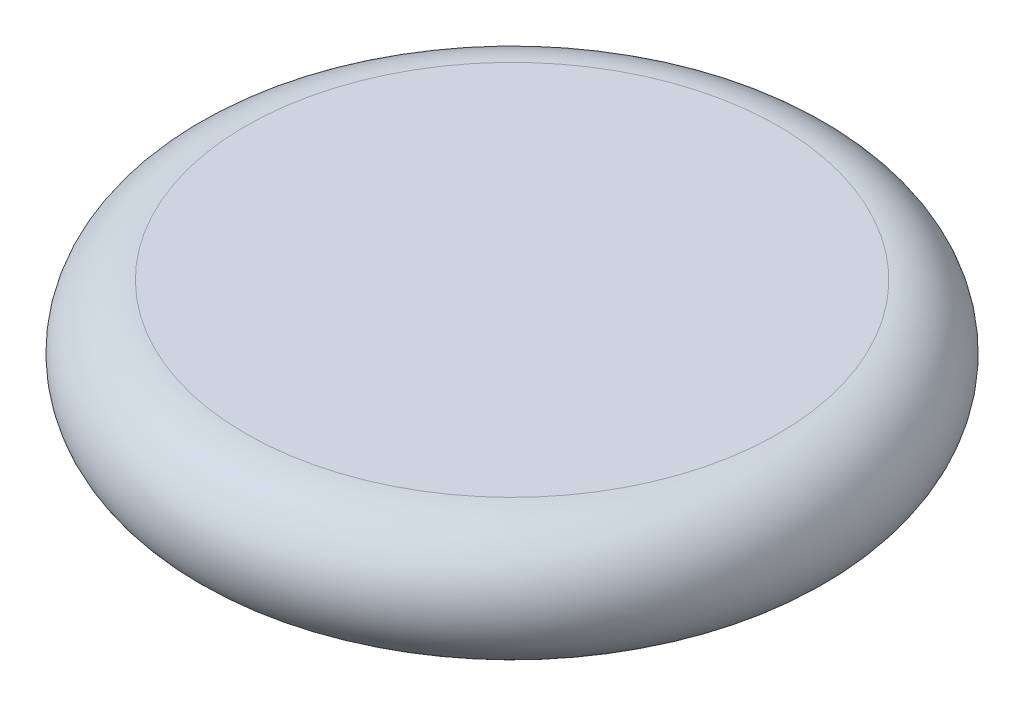
ISO-10303-21;
HEADER;
FILE_DESCRIPTION(('STEP AP214'),'2;1');
FILE_NAME('part.step','',(''),(''),'','','');
FILE_SCHEMA(('AUTOMOTIVE_DESIGN { 1 0 10303 214 1 1 1 1 }'));
ENDSEC;
DATA;
#1=APPLICATION_CONTEXT('core data for automotive mechanical design processes');
#2=APPLICATION_PROTOCOL_DEFINITION('international standard','automotive_design',2000,#1);
#3=PRODUCT_CONTEXT('',#1,'mechanical');
#4=PRODUCT('Part','Part','',(#3));
#5=PRODUCT_RELATED_PRODUCT_CATEGORY('part','',(#4));
#6=PRODUCT_DEFINITION_FORMATION('','',#4);
#7=PRODUCT_DEFINITION_CONTEXT('part definition',#1,'design');
#8=PRODUCT_DEFINITION('design','',#6,#7);
#9=PRODUCT_DEFINITION_SHAPE('','',#8);
#10=(LENGTH_UNIT() NAMED_UNIT(*) SI_UNIT(.MILLI.,.METRE.));
#11=(NAMED_UNIT(*) PLANE_ANGLE_UNIT() SI_UNIT($,.RADIAN.));
#12=(NAMED_UNIT(*) SI_UNIT($,.STERADIAN.) SOLID_ANGLE_UNIT());
#13=UNCERTAINTY_MEASURE_WITH_UNIT(LENGTH_MEASURE(1.E-05),#10,'distance_accuracy_value','');
#14=(GEOMETRIC_REPRESENTATION_CONTEXT(3) GLOBAL_UNCERTAINTY_ASSIGNED_CONTEXT((#13)) GLOBAL_UNIT_ASSIGNED_CONTEXT((#10,
#11,#12)) REPRESENTATION_CONTEXT('',''));
#15=CARTESIAN_POINT('',(0.,0.,0.));
#16=DIRECTION('',(0.,0.,1.));
#17=DIRECTION('',(1.,0.,0.));
#18=AXIS2_PLACEMENT_3D('',#15,#16,#17);
#19=CARTESIAN_POINT('',(0.,0.,0.));
#20=DIRECTION('',(0.,-1.,0.));
#21=DIRECTION('',(0.,0.,-1.));
#22=AXIS2_PLACEMENT_3D('',#19,#20,#21);
#23=PLANE('',#22);
#24=CARTESIAN_POINT('',(0.,0.,0.));
#25=DIRECTION('',(0.,1.,0.));
#26=DIRECTION('',(0.,0.,1.));
#27=AXIS2_PLACEMENT_3D('',#24,#25,#26);
#28=CIRCLE('',#27,40.);
#29=CARTESIAN_POINT('',(0.,0.,40.));
#30=VERTEX_POINT('',#29);
#31=EDGE_CURVE('E10',#30,#30,#28,.T.);
#32=ORIENTED_EDGE('',*,*,#31,.T.);
#33=EDGE_LOOP('',(#32));
#34=FACE_BOUND('',#33,.T.);
#35=ADVANCED_FACE('F37',(#34),#23,.F.);
#36=CARTESIAN_POINT('',(0.,-9.5,0.));
#37=DIRECTION('',(0.,1.,0.));
#38=DIRECTION('',(0.,0.,1.));
#39=AXIS2_PLACEMENT_3D('',#36,#37,#38);
#40=TOROIDAL_SURFACE('',#39,40.,9.5);
#41=ORIENTED_EDGE('',*,*,#31,.F.);
#42=EDGE_LOOP('',(#41));
#43=FACE_BOUND('',#42,.T.);
#44=CARTESIAN_POINT('',(0.,-19.,0.));
#45=DIRECTION('',(0.,1.,0.));
#46=DIRECTION('',(0.,0.,1.));
#47=AXIS2_PLACEMENT_3D('',#44,#45,#46);
#48=CIRCLE('',#47,40.);
#49=CARTESIAN_POINT('',(0.,-19.,40.));
#50=VERTEX_POINT('',#49);
#51=EDGE_CURVE('E44',#50,#50,#48,.T.);
#52=ORIENTED_EDGE('',*,*,#51,.T.);
#53=EDGE_LOOP('',(#52));
#54=FACE_BOUND('',#53,.T.);
#55=ADVANCED_FACE('F51',(#43,#54),#40,.T.);
#56=CARTESIAN_POINT('',(0.,-19.,0.));
#57=DIRECTION('',(0.,1.,0.));
#58=DIRECTION('',(0.,0.,1.));
#59=AXIS2_PLACEMENT_3D('',#56,#57,#58);
#60=PLANE('',#59);
#61=ORIENTED_EDGE('',*,*,#51,.F.);
#62=EDGE_LOOP('',(#61));
#63=FACE_BOUND('',#62,.T.);
#64=ADVANCED_FACE('F53',(#63),#60,.F.);
#65=CLOSED_SHELL('',(#35,#55,#64));
#66=MANIFOLD_SOLID_BREP('B2',#65);
#67=ADVANCED_BREP_SHAPE_REPRESENTATION('',(#18,#66),#14);
#68=SHAPE_DEFINITION_REPRESENTATION(#9,#67);
ENDSEC;
END-ISO-10303-21;
